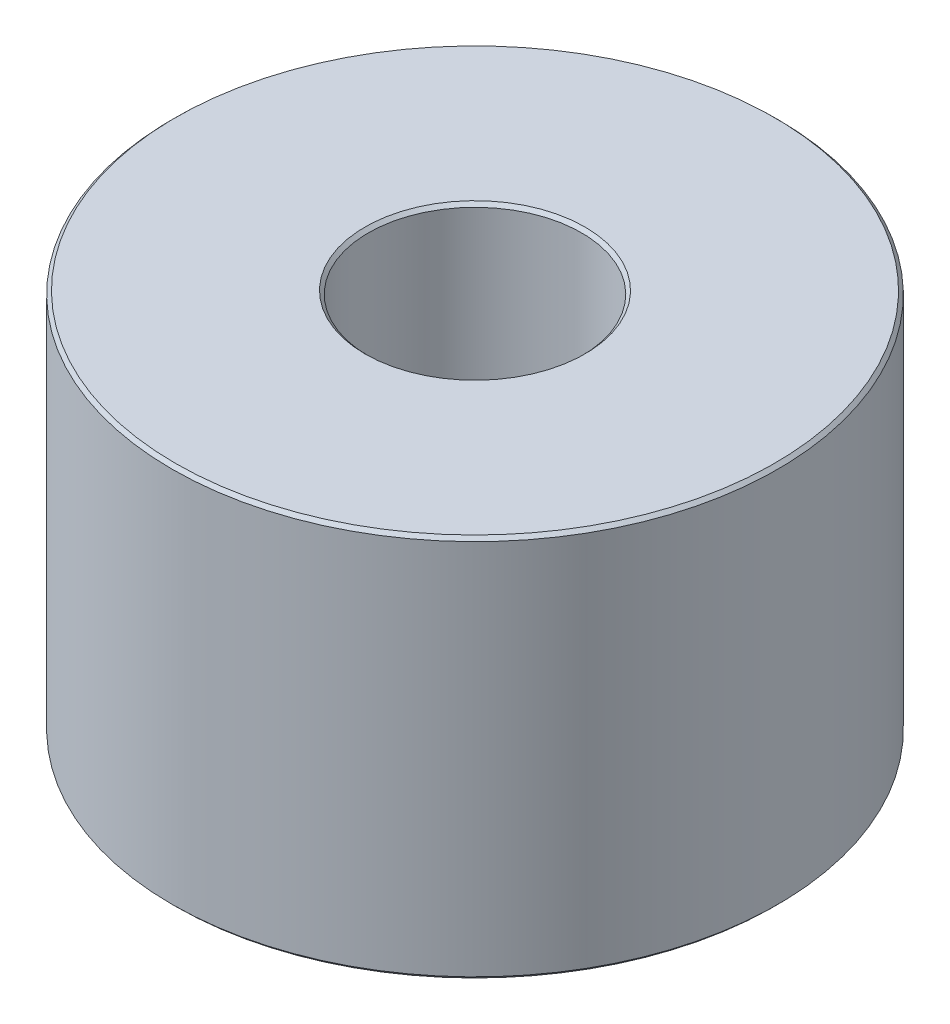
ISO-10303-21;
HEADER;
FILE_DESCRIPTION(('STEP AP214'),'2;1');
FILE_NAME('part.step','',(''),(''),'','','');
FILE_SCHEMA(('AUTOMOTIVE_DESIGN { 1 0 10303 214 1 1 1 1 }'));
ENDSEC;
DATA;
#1=APPLICATION_CONTEXT('core data for automotive mechanical design processes');
#2=APPLICATION_PROTOCOL_DEFINITION('international standard','automotive_design',2000,#1);
#3=PRODUCT_CONTEXT('',#1,'mechanical');
#4=PRODUCT('Part','Part','',(#3));
#5=PRODUCT_RELATED_PRODUCT_CATEGORY('part','',(#4));
#6=PRODUCT_DEFINITION_FORMATION('','',#4);
#7=PRODUCT_DEFINITION_CONTEXT('part definition',#1,'design');
#8=PRODUCT_DEFINITION('design','',#6,#7);
#9=PRODUCT_DEFINITION_SHAPE('','',#8);
#10=(LENGTH_UNIT() NAMED_UNIT(*) SI_UNIT(.MILLI.,.METRE.));
#11=(NAMED_UNIT(*) PLANE_ANGLE_UNIT() SI_UNIT($,.RADIAN.));
#12=(NAMED_UNIT(*) SI_UNIT($,.STERADIAN.) SOLID_ANGLE_UNIT());
#13=UNCERTAINTY_MEASURE_WITH_UNIT(LENGTH_MEASURE(1.E-05),#10,'distance_accuracy_value','');
#14=(GEOMETRIC_REPRESENTATION_CONTEXT(3) GLOBAL_UNCERTAINTY_ASSIGNED_CONTEXT((#13)) GLOBAL_UNIT_ASSIGNED_CONTEXT((#10,
#11,#12)) REPRESENTATION_CONTEXT('',''));
#15=CARTESIAN_POINT('',(0.,0.,0.));
#16=DIRECTION('',(0.,0.,1.));
#17=DIRECTION('',(1.,0.,0.));
#18=AXIS2_PLACEMENT_3D('',#15,#16,#17);
#19=CARTESIAN_POINT('',(0.,0.,0.));
#20=DIRECTION('',(0.,1.,0.));
#21=DIRECTION('',(0.,0.,1.));
#22=AXIS2_PLACEMENT_3D('',#19,#20,#21);
#23=PLANE('',#22);
#24=CARTESIAN_POINT('',(0.,0.,0.));
#25=DIRECTION('',(0.,1.,0.));
#26=DIRECTION('',(0.,0.,1.));
#27=AXIS2_PLACEMENT_3D('',#24,#25,#26);
#28=CIRCLE('',#27,3.26865);
#29=CARTESIAN_POINT('',(0.,0.,3.26865));
#30=VERTEX_POINT('',#29);
#31=EDGE_CURVE('E10',#30,#30,#28,.T.);
#32=ORIENTED_EDGE('',*,*,#31,.T.);
#33=EDGE_LOOP('',(#32));
#34=FACE_BOUND('',#33,.T.);
#35=CARTESIAN_POINT('',(0.,0.,0.));
#36=DIRECTION('',(0.,1.,0.));
#37=DIRECTION('',(0.,0.,1.));
#38=AXIS2_PLACEMENT_3D('',#35,#36,#37);
#39=CIRCLE('',#38,5.5);
#40=CARTESIAN_POINT('',(0.,0.,5.5));
#41=VERTEX_POINT('',#40);
#42=EDGE_CURVE('E71',#41,#41,#39,.T.);
#43=ORIENTED_EDGE('',*,*,#42,.F.);
#44=EDGE_LOOP('',(#43));
#45=FACE_BOUND('',#44,.T.);
#46=ADVANCED_FACE('F33',(#34,#45),#23,.F.);
#47=CARTESIAN_POINT('',(0.,10.,0.));
#48=DIRECTION('',(0.,-1.,0.));
#49=DIRECTION('',(0.,0.,-1.));
#50=AXIS2_PLACEMENT_3D('',#47,#48,#49);
#51=CYLINDRICAL_SURFACE('',#50,9.);
#52=CARTESIAN_POINT('',(0.,-1.3,0.));
#53=DIRECTION('',(0.,1.,0.));
#54=DIRECTION('',(0.,0.,1.));
#55=AXIS2_PLACEMENT_3D('',#52,#53,#54);
#56=CIRCLE('',#55,9.);
#57=CARTESIAN_POINT('',(0.,-1.3,9.));
#58=VERTEX_POINT('',#57);
#59=EDGE_CURVE('E65',#58,#58,#56,.T.);
#60=ORIENTED_EDGE('',*,*,#59,.T.);
#61=EDGE_LOOP('',(#60));
#62=FACE_BOUND('',#61,.T.);
#63=CARTESIAN_POINT('',(0.,9.9,0.));
#64=DIRECTION('',(0.,1.,0.));
#65=DIRECTION('',(0.,0.,1.));
#66=AXIS2_PLACEMENT_3D('',#63,#64,#65);
#67=CIRCLE('',#66,9.);
#68=CARTESIAN_POINT('',(0.,9.9,9.));
#69=VERTEX_POINT('',#68);
#70=EDGE_CURVE('E68',#69,#69,#67,.F.);
#71=ORIENTED_EDGE('',*,*,#70,.T.);
#72=EDGE_LOOP('',(#71));
#73=FACE_BOUND('',#72,.T.);
#74=ADVANCED_FACE('F78',(#62,#73),#51,.T.);
#75=CARTESIAN_POINT('',(0.,10.,0.));
#76=DIRECTION('',(0.,-1.,0.));
#77=DIRECTION('',(0.,0.,-1.));
#78=AXIS2_PLACEMENT_3D('',#75,#76,#77);
#79=CYLINDRICAL_SURFACE('',#78,3.16865);
#80=CARTESIAN_POINT('',(0.,9.9,0.));
#81=DIRECTION('',(0.,1.,0.));
#82=DIRECTION('',(0.,0.,1.));
#83=AXIS2_PLACEMENT_3D('',#80,#81,#82);
#84=CIRCLE('',#83,3.16865);
#85=CARTESIAN_POINT('',(0.,9.9,3.16865));
#86=VERTEX_POINT('',#85);
#87=EDGE_CURVE('E48',#86,#86,#84,.T.);
#88=ORIENTED_EDGE('',*,*,#87,.T.);
#89=EDGE_LOOP('',(#88));
#90=FACE_BOUND('',#89,.T.);
#91=CARTESIAN_POINT('',(0.,0.100000000000001,0.));
#92=DIRECTION('',(0.,1.,0.));
#93=DIRECTION('',(0.,0.,1.));
#94=AXIS2_PLACEMENT_3D('',#91,#92,#93);
#95=CIRCLE('',#94,3.16865);
#96=CARTESIAN_POINT('',(0.,0.100000000000001,3.16865));
#97=VERTEX_POINT('',#96);
#98=EDGE_CURVE('E53',#97,#97,#95,.F.);
#99=ORIENTED_EDGE('',*,*,#98,.T.);
#100=EDGE_LOOP('',(#99));
#101=FACE_BOUND('',#100,.T.);
#102=ADVANCED_FACE('F83',(#90,#101),#79,.F.);
#103=CARTESIAN_POINT('',(0.,10.,0.));
#104=DIRECTION('',(0.,1.,0.));
#105=DIRECTION('',(0.,0.,1.));
#106=AXIS2_PLACEMENT_3D('',#103,#104,#105);
#107=PLANE('',#106);
#108=CARTESIAN_POINT('',(0.,10.,0.));
#109=DIRECTION('',(0.,1.,0.));
#110=DIRECTION('',(0.,0.,1.));
#111=AXIS2_PLACEMENT_3D('',#108,#109,#110);
#112=CIRCLE('',#111,3.26865000000001);
#113=CARTESIAN_POINT('',(0.,10.,3.26865000000001));
#114=VERTEX_POINT('',#113);
#115=EDGE_CURVE('E40',#114,#114,#112,.F.);
#116=ORIENTED_EDGE('',*,*,#115,.T.);
#117=EDGE_LOOP('',(#116));
#118=FACE_BOUND('',#117,.T.);
#119=CARTESIAN_POINT('',(0.,10.,0.));
#120=DIRECTION('',(0.,1.,0.));
#121=DIRECTION('',(0.,0.,1.));
#122=AXIS2_PLACEMENT_3D('',#119,#120,#121);
#123=CIRCLE('',#122,8.9);
#124=CARTESIAN_POINT('',(0.,10.,8.9));
#125=VERTEX_POINT('',#124);
#126=EDGE_CURVE('E44',#125,#125,#123,.T.);
#127=ORIENTED_EDGE('',*,*,#126,.T.);
#128=EDGE_LOOP('',(#127));
#129=FACE_BOUND('',#128,.T.);
#130=ADVANCED_FACE('F88',(#118,#129),#107,.T.);
#131=CARTESIAN_POINT('',(0.,-1.4,0.));
#132=DIRECTION('',(0.,1.,0.));
#133=DIRECTION('',(0.,0.,1.));
#134=AXIS2_PLACEMENT_3D('',#131,#132,#133);
#135=CYLINDRICAL_SURFACE('',#134,5.5);
#136=CARTESIAN_POINT('',(0.,-1.3,0.));
#137=DIRECTION('',(0.,1.,0.));
#138=DIRECTION('',(0.,0.,1.));
#139=AXIS2_PLACEMENT_3D('',#136,#137,#138);
#140=CIRCLE('',#139,5.5);
#141=CARTESIAN_POINT('',(0.,-1.3,5.5));
#142=VERTEX_POINT('',#141);
#143=EDGE_CURVE('E56',#142,#142,#140,.F.);
#144=ORIENTED_EDGE('',*,*,#143,.T.);
#145=EDGE_LOOP('',(#144));
#146=FACE_BOUND('',#145,.T.);
#147=ORIENTED_EDGE('',*,*,#42,.T.);
#148=EDGE_LOOP('',(#147));
#149=FACE_BOUND('',#148,.T.);
#150=ADVANCED_FACE('F75',(#146,#149),#135,.F.);
#151=CARTESIAN_POINT('',(0.,-1.4,0.));
#152=DIRECTION('',(0.,1.,0.));
#153=DIRECTION('',(0.,0.,1.));
#154=AXIS2_PLACEMENT_3D('',#151,#152,#153);
#155=PLANE('',#154);
#156=CARTESIAN_POINT('',(0.,-1.4,0.));
#157=DIRECTION('',(0.,1.,0.));
#158=DIRECTION('',(0.,0.,1.));
#159=AXIS2_PLACEMENT_3D('',#156,#157,#158);
#160=CIRCLE('',#159,8.9);
#161=CARTESIAN_POINT('',(0.,-1.4,8.9));
#162=VERTEX_POINT('',#161);
#163=EDGE_CURVE('E59',#162,#162,#160,.F.);
#164=ORIENTED_EDGE('',*,*,#163,.T.);
#165=EDGE_LOOP('',(#164));
#166=FACE_BOUND('',#165,.T.);
#167=CARTESIAN_POINT('',(0.,-1.4,0.));
#168=DIRECTION('',(0.,1.,0.));
#169=DIRECTION('',(0.,0.,1.));
#170=AXIS2_PLACEMENT_3D('',#167,#168,#169);
#171=CIRCLE('',#170,5.6);
#172=CARTESIAN_POINT('',(0.,-1.4,5.6));
#173=VERTEX_POINT('',#172);
#174=EDGE_CURVE('E62',#173,#173,#171,.T.);
#175=ORIENTED_EDGE('',*,*,#174,.T.);
#176=EDGE_LOOP('',(#175));
#177=FACE_BOUND('',#176,.T.);
#178=ADVANCED_FACE('F97',(#166,#177),#155,.F.);
#179=CARTESIAN_POINT('',(0.,-1.3,0.));
#180=DIRECTION('',(0.,1.,0.));
#181=DIRECTION('',(0.,0.,1.));
#182=AXIS2_PLACEMENT_3D('',#179,#180,#181);
#183=CONICAL_SURFACE('',#182,9.,0.785398163397448);
#184=ORIENTED_EDGE('',*,*,#163,.F.);
#185=EDGE_LOOP('',(#184));
#186=FACE_BOUND('',#185,.T.);
#187=ORIENTED_EDGE('',*,*,#59,.F.);
#188=EDGE_LOOP('',(#187));
#189=FACE_BOUND('',#188,.T.);
#190=ADVANCED_FACE('F93',(#186,#189),#183,.T.);
#191=CARTESIAN_POINT('',(0.,-1.4,0.));
#192=DIRECTION('',(0.,-1.,0.));
#193=DIRECTION('',(0.,0.,-1.));
#194=AXIS2_PLACEMENT_3D('',#191,#192,#193);
#195=CONICAL_SURFACE('',#194,5.6,0.785398163397457);
#196=ORIENTED_EDGE('',*,*,#143,.F.);
#197=EDGE_LOOP('',(#196));
#198=FACE_BOUND('',#197,.T.);
#199=ORIENTED_EDGE('',*,*,#174,.F.);
#200=EDGE_LOOP('',(#199));
#201=FACE_BOUND('',#200,.T.);
#202=ADVANCED_FACE('F96',(#198,#201),#195,.F.);
#203=CARTESIAN_POINT('',(0.,9.9,0.));
#204=DIRECTION('',(0.,1.,0.));
#205=DIRECTION('',(0.,0.,1.));
#206=AXIS2_PLACEMENT_3D('',#203,#204,#205);
#207=CONICAL_SURFACE('',#206,3.16865,0.785398163397453);
#208=ORIENTED_EDGE('',*,*,#115,.F.);
#209=EDGE_LOOP('',(#208));
#210=FACE_BOUND('',#209,.T.);
#211=ORIENTED_EDGE('',*,*,#87,.F.);
#212=EDGE_LOOP('',(#211));
#213=FACE_BOUND('',#212,.T.);
#214=ADVANCED_FACE('F101',(#210,#213),#207,.F.);
#215=CARTESIAN_POINT('',(0.,10.,0.));
#216=DIRECTION('',(0.,-1.,0.));
#217=DIRECTION('',(0.,0.,-1.));
#218=AXIS2_PLACEMENT_3D('',#215,#216,#217);
#219=CONICAL_SURFACE('',#218,8.9,0.785398163397457);
#220=ORIENTED_EDGE('',*,*,#70,.F.);
#221=EDGE_LOOP('',(#220));
#222=FACE_BOUND('',#221,.T.);
#223=ORIENTED_EDGE('',*,*,#126,.F.);
#224=EDGE_LOOP('',(#223));
#225=FACE_BOUND('',#224,.T.);
#226=ADVANCED_FACE('F104',(#222,#225),#219,.T.);
#227=CARTESIAN_POINT('',(0.,0.,0.));
#228=DIRECTION('',(0.,-1.,0.));
#229=DIRECTION('',(0.,0.,-1.));
#230=AXIS2_PLACEMENT_3D('',#227,#228,#229);
#231=CONICAL_SURFACE('',#230,3.26865,0.78539816339745);
#232=ORIENTED_EDGE('',*,*,#98,.F.);
#233=EDGE_LOOP('',(#232));
#234=FACE_BOUND('',#233,.T.);
#235=ORIENTED_EDGE('',*,*,#31,.F.);
#236=EDGE_LOOP('',(#235));
#237=FACE_BOUND('',#236,.T.);
#238=ADVANCED_FACE('F35',(#234,#237),#231,.F.);
#239=CLOSED_SHELL('',(#46,#74,#102,#130,#150,#178,#190,#202,#214,#226,#238));
#240=MANIFOLD_SOLID_BREP('B2',#239);
#241=ADVANCED_BREP_SHAPE_REPRESENTATION('',(#18,#240),#14);
#242=SHAPE_DEFINITION_REPRESENTATION(#9,#241);
ENDSEC;
END-ISO-10303-21;
